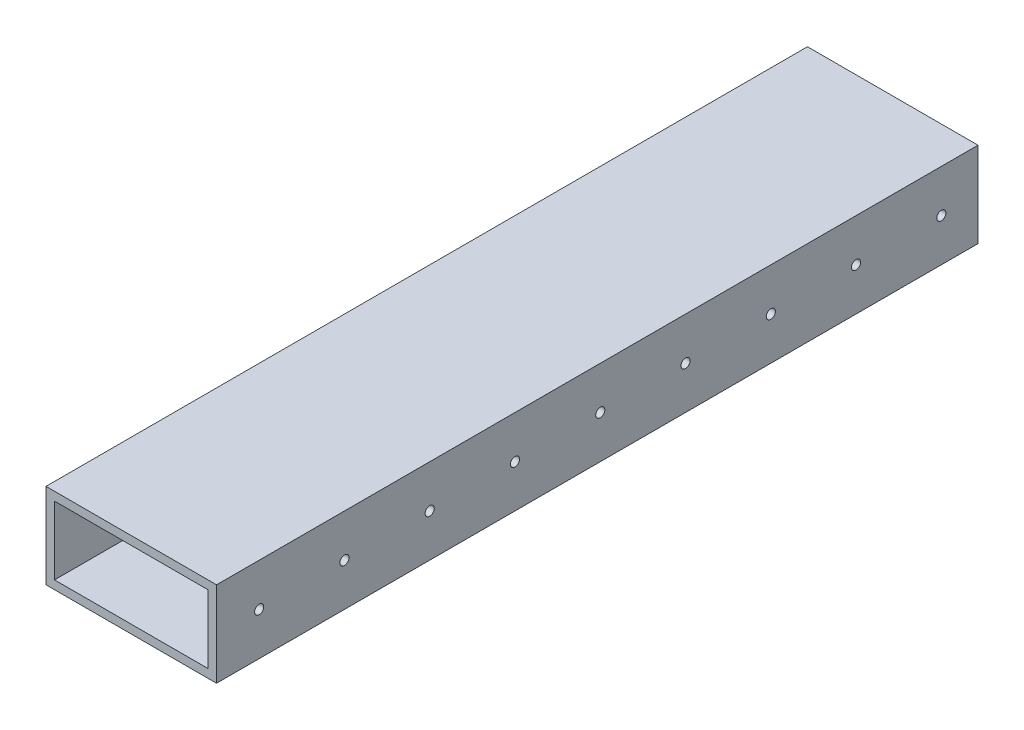
ISO-10303-21;
HEADER;
FILE_DESCRIPTION(('STEP AP214'),'2;1');
FILE_NAME('part.step','',(''),(''),'','','');
FILE_SCHEMA(('AUTOMOTIVE_DESIGN { 1 0 10303 214 1 1 1 1 }'));
ENDSEC;
DATA;
#1=APPLICATION_CONTEXT('core data for automotive mechanical design processes');
#2=APPLICATION_PROTOCOL_DEFINITION('international standard','automotive_design',2000,#1);
#3=PRODUCT_CONTEXT('',#1,'mechanical');
#4=PRODUCT('Part','Part','',(#3));
#5=PRODUCT_RELATED_PRODUCT_CATEGORY('part','',(#4));
#6=PRODUCT_DEFINITION_FORMATION('','',#4);
#7=PRODUCT_DEFINITION_CONTEXT('part definition',#1,'design');
#8=PRODUCT_DEFINITION('design','',#6,#7);
#9=PRODUCT_DEFINITION_SHAPE('','',#8);
#10=(LENGTH_UNIT() NAMED_UNIT(*) SI_UNIT(.MILLI.,.METRE.));
#11=(NAMED_UNIT(*) PLANE_ANGLE_UNIT() SI_UNIT($,.RADIAN.));
#12=(NAMED_UNIT(*) SI_UNIT($,.STERADIAN.) SOLID_ANGLE_UNIT());
#13=UNCERTAINTY_MEASURE_WITH_UNIT(LENGTH_MEASURE(1.E-05),#10,'distance_accuracy_value','');
#14=(GEOMETRIC_REPRESENTATION_CONTEXT(3) GLOBAL_UNCERTAINTY_ASSIGNED_CONTEXT((#13)) GLOBAL_UNIT_ASSIGNED_CONTEXT((#10,
#11,#12)) REPRESENTATION_CONTEXT('',''));
#15=CARTESIAN_POINT('',(0.,0.,0.));
#16=DIRECTION('',(0.,0.,1.));
#17=DIRECTION('',(1.,0.,0.));
#18=AXIS2_PLACEMENT_3D('',#15,#16,#17);
#19=CARTESIAN_POINT('',(-25.4,0.,-102.489));
#20=DIRECTION('',(1.,0.,0.));
#21=DIRECTION('',(0.,0.,-1.));
#22=AXIS2_PLACEMENT_3D('',#19,#20,#21);
#23=CYLINDRICAL_SURFACE('',#22,1.3589);
#24=CARTESIAN_POINT('',(-22.86,0.,-102.489));
#25=DIRECTION('',(1.,0.,0.));
#26=DIRECTION('',(0.,0.,-1.));
#27=AXIS2_PLACEMENT_3D('',#24,#25,#26);
#28=CIRCLE('',#27,1.3589);
#29=CARTESIAN_POINT('',(-22.86,0.,-103.8479));
#30=VERTEX_POINT('',#29);
#31=EDGE_CURVE('E70',#30,#30,#28,.T.);
#32=ORIENTED_EDGE('',*,*,#31,.T.);
#33=EDGE_LOOP('',(#32));
#34=FACE_BOUND('',#33,.T.);
#35=CARTESIAN_POINT('',(-25.4,0.,-102.489));
#36=DIRECTION('',(1.,0.,0.));
#37=DIRECTION('',(0.,0.,-1.));
#38=AXIS2_PLACEMENT_3D('',#35,#36,#37);
#39=CIRCLE('',#38,1.3589);
#40=CARTESIAN_POINT('',(-25.4,0.,-103.8479));
#41=VERTEX_POINT('',#40);
#42=EDGE_CURVE('E12',#41,#41,#39,.T.);
#43=ORIENTED_EDGE('',*,*,#42,.F.);
#44=EDGE_LOOP('',(#43));
#45=FACE_BOUND('',#44,.T.);
#46=ADVANCED_FACE('F63',(#34,#45),#23,.F.);
#47=CARTESIAN_POINT('',(-25.4,0.,-77.089));
#48=DIRECTION('',(1.,0.,0.));
#49=DIRECTION('',(0.,0.,-1.));
#50=AXIS2_PLACEMENT_3D('',#47,#48,#49);
#51=CYLINDRICAL_SURFACE('',#50,1.3589);
#52=CARTESIAN_POINT('',(-22.86,0.,-77.089));
#53=DIRECTION('',(1.,0.,0.));
#54=DIRECTION('',(0.,0.,-1.));
#55=AXIS2_PLACEMENT_3D('',#52,#53,#54);
#56=CIRCLE('',#55,1.3589);
#57=CARTESIAN_POINT('',(-22.86,0.,-78.4479));
#58=VERTEX_POINT('',#57);
#59=EDGE_CURVE('E272',#58,#58,#56,.T.);
#60=ORIENTED_EDGE('',*,*,#59,.T.);
#61=EDGE_LOOP('',(#60));
#62=FACE_BOUND('',#61,.T.);
#63=CARTESIAN_POINT('',(-25.4,0.,-77.089));
#64=DIRECTION('',(1.,0.,0.));
#65=DIRECTION('',(0.,0.,-1.));
#66=AXIS2_PLACEMENT_3D('',#63,#64,#65);
#67=CIRCLE('',#66,1.3589);
#68=CARTESIAN_POINT('',(-25.4,0.,-78.4479));
#69=VERTEX_POINT('',#68);
#70=EDGE_CURVE('E275',#69,#69,#67,.T.);
#71=ORIENTED_EDGE('',*,*,#70,.F.);
#72=EDGE_LOOP('',(#71));
#73=FACE_BOUND('',#72,.T.);
#74=ADVANCED_FACE('F297',(#62,#73),#51,.F.);
#75=CARTESIAN_POINT('',(-25.4,0.,-51.689));
#76=DIRECTION('',(1.,0.,0.));
#77=DIRECTION('',(0.,0.,-1.));
#78=AXIS2_PLACEMENT_3D('',#75,#76,#77);
#79=CYLINDRICAL_SURFACE('',#78,1.3589);
#80=CARTESIAN_POINT('',(-22.86,0.,-51.689));
#81=DIRECTION('',(1.,0.,0.));
#82=DIRECTION('',(0.,0.,-1.));
#83=AXIS2_PLACEMENT_3D('',#80,#81,#82);
#84=CIRCLE('',#83,1.3589);
#85=CARTESIAN_POINT('',(-22.86,0.,-53.0479));
#86=VERTEX_POINT('',#85);
#87=EDGE_CURVE('E266',#86,#86,#84,.T.);
#88=ORIENTED_EDGE('',*,*,#87,.T.);
#89=EDGE_LOOP('',(#88));
#90=FACE_BOUND('',#89,.T.);
#91=CARTESIAN_POINT('',(-25.4,0.,-51.689));
#92=DIRECTION('',(1.,0.,0.));
#93=DIRECTION('',(0.,0.,-1.));
#94=AXIS2_PLACEMENT_3D('',#91,#92,#93);
#95=CIRCLE('',#94,1.3589);
#96=CARTESIAN_POINT('',(-25.4,0.,-53.0479));
#97=VERTEX_POINT('',#96);
#98=EDGE_CURVE('E269',#97,#97,#95,.T.);
#99=ORIENTED_EDGE('',*,*,#98,.F.);
#100=EDGE_LOOP('',(#99));
#101=FACE_BOUND('',#100,.T.);
#102=ADVANCED_FACE('F301',(#90,#101),#79,.F.);
#103=CARTESIAN_POINT('',(-25.4,0.,-26.289));
#104=DIRECTION('',(1.,0.,0.));
#105=DIRECTION('',(0.,0.,-1.));
#106=AXIS2_PLACEMENT_3D('',#103,#104,#105);
#107=CYLINDRICAL_SURFACE('',#106,1.3589);
#108=CARTESIAN_POINT('',(-22.86,0.,-26.289));
#109=DIRECTION('',(1.,0.,0.));
#110=DIRECTION('',(0.,0.,-1.));
#111=AXIS2_PLACEMENT_3D('',#108,#109,#110);
#112=CIRCLE('',#111,1.3589);
#113=CARTESIAN_POINT('',(-22.86,0.,-27.6479));
#114=VERTEX_POINT('',#113);
#115=EDGE_CURVE('E260',#114,#114,#112,.T.);
#116=ORIENTED_EDGE('',*,*,#115,.T.);
#117=EDGE_LOOP('',(#116));
#118=FACE_BOUND('',#117,.T.);
#119=CARTESIAN_POINT('',(-25.4,0.,-26.289));
#120=DIRECTION('',(1.,0.,0.));
#121=DIRECTION('',(0.,0.,-1.));
#122=AXIS2_PLACEMENT_3D('',#119,#120,#121);
#123=CIRCLE('',#122,1.3589);
#124=CARTESIAN_POINT('',(-25.4,0.,-27.6479));
#125=VERTEX_POINT('',#124);
#126=EDGE_CURVE('E263',#125,#125,#123,.T.);
#127=ORIENTED_EDGE('',*,*,#126,.F.);
#128=EDGE_LOOP('',(#127));
#129=FACE_BOUND('',#128,.T.);
#130=ADVANCED_FACE('F306',(#118,#129),#107,.F.);
#131=CARTESIAN_POINT('',(-25.4,0.,-0.889000000000001));
#132=DIRECTION('',(1.,0.,0.));
#133=DIRECTION('',(0.,0.,-1.));
#134=AXIS2_PLACEMENT_3D('',#131,#132,#133);
#135=CYLINDRICAL_SURFACE('',#134,1.3589);
#136=CARTESIAN_POINT('',(-22.86,0.,-0.889000000000001));
#137=DIRECTION('',(1.,0.,0.));
#138=DIRECTION('',(0.,0.,-1.));
#139=AXIS2_PLACEMENT_3D('',#136,#137,#138);
#140=CIRCLE('',#139,1.3589);
#141=CARTESIAN_POINT('',(-22.86,0.,-2.2479));
#142=VERTEX_POINT('',#141);
#143=EDGE_CURVE('E254',#142,#142,#140,.T.);
#144=ORIENTED_EDGE('',*,*,#143,.T.);
#145=EDGE_LOOP('',(#144));
#146=FACE_BOUND('',#145,.T.);
#147=CARTESIAN_POINT('',(-25.4,0.,-0.889000000000001));
#148=DIRECTION('',(1.,0.,0.));
#149=DIRECTION('',(0.,0.,-1.));
#150=AXIS2_PLACEMENT_3D('',#147,#148,#149);
#151=CIRCLE('',#150,1.3589);
#152=CARTESIAN_POINT('',(-25.4,0.,-2.2479));
#153=VERTEX_POINT('',#152);
#154=EDGE_CURVE('E257',#153,#153,#151,.T.);
#155=ORIENTED_EDGE('',*,*,#154,.F.);
#156=EDGE_LOOP('',(#155));
#157=FACE_BOUND('',#156,.T.);
#158=ADVANCED_FACE('F313',(#146,#157),#135,.F.);
#159=CARTESIAN_POINT('',(-25.4,0.,24.511));
#160=DIRECTION('',(1.,0.,0.));
#161=DIRECTION('',(0.,0.,-1.));
#162=AXIS2_PLACEMENT_3D('',#159,#160,#161);
#163=CYLINDRICAL_SURFACE('',#162,1.3589);
#164=CARTESIAN_POINT('',(-22.86,0.,24.511));
#165=DIRECTION('',(1.,0.,0.));
#166=DIRECTION('',(0.,0.,-1.));
#167=AXIS2_PLACEMENT_3D('',#164,#165,#166);
#168=CIRCLE('',#167,1.3589);
#169=CARTESIAN_POINT('',(-22.86,0.,23.1521));
#170=VERTEX_POINT('',#169);
#171=EDGE_CURVE('E248',#170,#170,#168,.T.);
#172=ORIENTED_EDGE('',*,*,#171,.T.);
#173=EDGE_LOOP('',(#172));
#174=FACE_BOUND('',#173,.T.);
#175=CARTESIAN_POINT('',(-25.4,0.,24.511));
#176=DIRECTION('',(1.,0.,0.));
#177=DIRECTION('',(0.,0.,-1.));
#178=AXIS2_PLACEMENT_3D('',#175,#176,#177);
#179=CIRCLE('',#178,1.3589);
#180=CARTESIAN_POINT('',(-25.4,0.,23.1521));
#181=VERTEX_POINT('',#180);
#182=EDGE_CURVE('E251',#181,#181,#179,.T.);
#183=ORIENTED_EDGE('',*,*,#182,.F.);
#184=EDGE_LOOP('',(#183));
#185=FACE_BOUND('',#184,.T.);
#186=ADVANCED_FACE('F317',(#174,#185),#163,.F.);
#187=CARTESIAN_POINT('',(-25.4,0.,49.911));
#188=DIRECTION('',(1.,0.,0.));
#189=DIRECTION('',(0.,0.,-1.));
#190=AXIS2_PLACEMENT_3D('',#187,#188,#189);
#191=CYLINDRICAL_SURFACE('',#190,1.3589);
#192=CARTESIAN_POINT('',(-22.86,0.,49.911));
#193=DIRECTION('',(1.,0.,0.));
#194=DIRECTION('',(0.,0.,-1.));
#195=AXIS2_PLACEMENT_3D('',#192,#193,#194);
#196=CIRCLE('',#195,1.3589);
#197=CARTESIAN_POINT('',(-22.86,0.,48.5521));
#198=VERTEX_POINT('',#197);
#199=EDGE_CURVE('E242',#198,#198,#196,.T.);
#200=ORIENTED_EDGE('',*,*,#199,.T.);
#201=EDGE_LOOP('',(#200));
#202=FACE_BOUND('',#201,.T.);
#203=CARTESIAN_POINT('',(-25.4,0.,49.911));
#204=DIRECTION('',(1.,0.,0.));
#205=DIRECTION('',(0.,0.,-1.));
#206=AXIS2_PLACEMENT_3D('',#203,#204,#205);
#207=CIRCLE('',#206,1.3589);
#208=CARTESIAN_POINT('',(-25.4,0.,48.5521));
#209=VERTEX_POINT('',#208);
#210=EDGE_CURVE('E245',#209,#209,#207,.T.);
#211=ORIENTED_EDGE('',*,*,#210,.F.);
#212=EDGE_LOOP('',(#211));
#213=FACE_BOUND('',#212,.T.);
#214=ADVANCED_FACE('F321',(#202,#213),#191,.F.);
#215=CARTESIAN_POINT('',(-25.4,0.,-102.489));
#216=DIRECTION('',(1.,0.,0.));
#217=DIRECTION('',(0.,0.,-1.));
#218=AXIS2_PLACEMENT_3D('',#215,#216,#217);
#219=CYLINDRICAL_SURFACE('',#218,1.3589);
#220=CARTESIAN_POINT('',(22.86,0.,-102.489));
#221=DIRECTION('',(-1.,0.,0.));
#222=DIRECTION('',(0.,0.,1.));
#223=AXIS2_PLACEMENT_3D('',#220,#221,#222);
#224=CIRCLE('',#223,1.3589);
#225=CARTESIAN_POINT('',(22.86,0.,-101.1301));
#226=VERTEX_POINT('',#225);
#227=EDGE_CURVE('E236',#226,#226,#224,.T.);
#228=ORIENTED_EDGE('',*,*,#227,.T.);
#229=EDGE_LOOP('',(#228));
#230=FACE_BOUND('',#229,.T.);
#231=CARTESIAN_POINT('',(25.4,0.,-102.489));
#232=DIRECTION('',(1.,0.,0.));
#233=DIRECTION('',(0.,0.,-1.));
#234=AXIS2_PLACEMENT_3D('',#231,#232,#233);
#235=CIRCLE('',#234,1.3589);
#236=CARTESIAN_POINT('',(25.4,0.,-103.8479));
#237=VERTEX_POINT('',#236);
#238=EDGE_CURVE('E239',#237,#237,#235,.T.);
#239=ORIENTED_EDGE('',*,*,#238,.T.);
#240=EDGE_LOOP('',(#239));
#241=FACE_BOUND('',#240,.T.);
#242=ADVANCED_FACE('F325',(#230,#241),#219,.F.);
#243=CARTESIAN_POINT('',(-25.4,0.,-77.089));
#244=DIRECTION('',(1.,0.,0.));
#245=DIRECTION('',(0.,0.,-1.));
#246=AXIS2_PLACEMENT_3D('',#243,#244,#245);
#247=CYLINDRICAL_SURFACE('',#246,1.3589);
#248=CARTESIAN_POINT('',(22.86,0.,-77.089));
#249=DIRECTION('',(-1.,0.,0.));
#250=DIRECTION('',(0.,0.,1.));
#251=AXIS2_PLACEMENT_3D('',#248,#249,#250);
#252=CIRCLE('',#251,1.3589);
#253=CARTESIAN_POINT('',(22.86,0.,-75.7301));
#254=VERTEX_POINT('',#253);
#255=EDGE_CURVE('E230',#254,#254,#252,.T.);
#256=ORIENTED_EDGE('',*,*,#255,.T.);
#257=EDGE_LOOP('',(#256));
#258=FACE_BOUND('',#257,.T.);
#259=CARTESIAN_POINT('',(25.4,0.,-77.089));
#260=DIRECTION('',(1.,0.,0.));
#261=DIRECTION('',(0.,0.,-1.));
#262=AXIS2_PLACEMENT_3D('',#259,#260,#261);
#263=CIRCLE('',#262,1.3589);
#264=CARTESIAN_POINT('',(25.4,0.,-78.4479));
#265=VERTEX_POINT('',#264);
#266=EDGE_CURVE('E233',#265,#265,#263,.T.);
#267=ORIENTED_EDGE('',*,*,#266,.T.);
#268=EDGE_LOOP('',(#267));
#269=FACE_BOUND('',#268,.T.);
#270=ADVANCED_FACE('F329',(#258,#269),#247,.F.);
#271=CARTESIAN_POINT('',(-25.4,0.,-51.689));
#272=DIRECTION('',(1.,0.,0.));
#273=DIRECTION('',(0.,0.,-1.));
#274=AXIS2_PLACEMENT_3D('',#271,#272,#273);
#275=CYLINDRICAL_SURFACE('',#274,1.3589);
#276=CARTESIAN_POINT('',(22.86,0.,-51.689));
#277=DIRECTION('',(-1.,0.,0.));
#278=DIRECTION('',(0.,0.,1.));
#279=AXIS2_PLACEMENT_3D('',#276,#277,#278);
#280=CIRCLE('',#279,1.3589);
#281=CARTESIAN_POINT('',(22.86,0.,-50.3301));
#282=VERTEX_POINT('',#281);
#283=EDGE_CURVE('E224',#282,#282,#280,.T.);
#284=ORIENTED_EDGE('',*,*,#283,.T.);
#285=EDGE_LOOP('',(#284));
#286=FACE_BOUND('',#285,.T.);
#287=CARTESIAN_POINT('',(25.4,0.,-51.689));
#288=DIRECTION('',(1.,0.,0.));
#289=DIRECTION('',(0.,0.,-1.));
#290=AXIS2_PLACEMENT_3D('',#287,#288,#289);
#291=CIRCLE('',#290,1.3589);
#292=CARTESIAN_POINT('',(25.4,0.,-53.0479));
#293=VERTEX_POINT('',#292);
#294=EDGE_CURVE('E227',#293,#293,#291,.T.);
#295=ORIENTED_EDGE('',*,*,#294,.T.);
#296=EDGE_LOOP('',(#295));
#297=FACE_BOUND('',#296,.T.);
#298=ADVANCED_FACE('F333',(#286,#297),#275,.F.);
#299=CARTESIAN_POINT('',(-25.4,0.,-26.289));
#300=DIRECTION('',(1.,0.,0.));
#301=DIRECTION('',(0.,0.,-1.));
#302=AXIS2_PLACEMENT_3D('',#299,#300,#301);
#303=CYLINDRICAL_SURFACE('',#302,1.3589);
#304=CARTESIAN_POINT('',(22.86,0.,-26.289));
#305=DIRECTION('',(-1.,0.,0.));
#306=DIRECTION('',(0.,0.,1.));
#307=AXIS2_PLACEMENT_3D('',#304,#305,#306);
#308=CIRCLE('',#307,1.3589);
#309=CARTESIAN_POINT('',(22.86,0.,-24.9301));
#310=VERTEX_POINT('',#309);
#311=EDGE_CURVE('E218',#310,#310,#308,.T.);
#312=ORIENTED_EDGE('',*,*,#311,.T.);
#313=EDGE_LOOP('',(#312));
#314=FACE_BOUND('',#313,.T.);
#315=CARTESIAN_POINT('',(25.4,0.,-26.289));
#316=DIRECTION('',(1.,0.,0.));
#317=DIRECTION('',(0.,0.,-1.));
#318=AXIS2_PLACEMENT_3D('',#315,#316,#317);
#319=CIRCLE('',#318,1.3589);
#320=CARTESIAN_POINT('',(25.4,0.,-27.6479));
#321=VERTEX_POINT('',#320);
#322=EDGE_CURVE('E221',#321,#321,#319,.T.);
#323=ORIENTED_EDGE('',*,*,#322,.T.);
#324=EDGE_LOOP('',(#323));
#325=FACE_BOUND('',#324,.T.);
#326=ADVANCED_FACE('F337',(#314,#325),#303,.F.);
#327=CARTESIAN_POINT('',(-25.4,0.,-0.889000000000001));
#328=DIRECTION('',(1.,0.,0.));
#329=DIRECTION('',(0.,0.,-1.));
#330=AXIS2_PLACEMENT_3D('',#327,#328,#329);
#331=CYLINDRICAL_SURFACE('',#330,1.3589);
#332=CARTESIAN_POINT('',(22.86,0.,-0.889000000000001));
#333=DIRECTION('',(-1.,0.,0.));
#334=DIRECTION('',(0.,0.,1.));
#335=AXIS2_PLACEMENT_3D('',#332,#333,#334);
#336=CIRCLE('',#335,1.3589);
#337=CARTESIAN_POINT('',(22.86,0.,0.4699));
#338=VERTEX_POINT('',#337);
#339=EDGE_CURVE('E212',#338,#338,#336,.T.);
#340=ORIENTED_EDGE('',*,*,#339,.T.);
#341=EDGE_LOOP('',(#340));
#342=FACE_BOUND('',#341,.T.);
#343=CARTESIAN_POINT('',(25.4,0.,-0.889000000000001));
#344=DIRECTION('',(1.,0.,0.));
#345=DIRECTION('',(0.,0.,-1.));
#346=AXIS2_PLACEMENT_3D('',#343,#344,#345);
#347=CIRCLE('',#346,1.3589);
#348=CARTESIAN_POINT('',(25.4,0.,-2.2479));
#349=VERTEX_POINT('',#348);
#350=EDGE_CURVE('E215',#349,#349,#347,.T.);
#351=ORIENTED_EDGE('',*,*,#350,.T.);
#352=EDGE_LOOP('',(#351));
#353=FACE_BOUND('',#352,.T.);
#354=ADVANCED_FACE('F341',(#342,#353),#331,.F.);
#355=CARTESIAN_POINT('',(-25.4,0.,24.511));
#356=DIRECTION('',(1.,0.,0.));
#357=DIRECTION('',(0.,0.,-1.));
#358=AXIS2_PLACEMENT_3D('',#355,#356,#357);
#359=CYLINDRICAL_SURFACE('',#358,1.3589);
#360=CARTESIAN_POINT('',(22.86,0.,24.511));
#361=DIRECTION('',(-1.,0.,0.));
#362=DIRECTION('',(0.,0.,1.));
#363=AXIS2_PLACEMENT_3D('',#360,#361,#362);
#364=CIRCLE('',#363,1.3589);
#365=CARTESIAN_POINT('',(22.86,0.,25.8699));
#366=VERTEX_POINT('',#365);
#367=EDGE_CURVE('E206',#366,#366,#364,.T.);
#368=ORIENTED_EDGE('',*,*,#367,.T.);
#369=EDGE_LOOP('',(#368));
#370=FACE_BOUND('',#369,.T.);
#371=CARTESIAN_POINT('',(25.4,0.,24.511));
#372=DIRECTION('',(1.,0.,0.));
#373=DIRECTION('',(0.,0.,-1.));
#374=AXIS2_PLACEMENT_3D('',#371,#372,#373);
#375=CIRCLE('',#374,1.3589);
#376=CARTESIAN_POINT('',(25.4,0.,23.1521));
#377=VERTEX_POINT('',#376);
#378=EDGE_CURVE('E209',#377,#377,#375,.T.);
#379=ORIENTED_EDGE('',*,*,#378,.T.);
#380=EDGE_LOOP('',(#379));
#381=FACE_BOUND('',#380,.T.);
#382=ADVANCED_FACE('F345',(#370,#381),#359,.F.);
#383=CARTESIAN_POINT('',(-25.4,0.,49.911));
#384=DIRECTION('',(1.,0.,0.));
#385=DIRECTION('',(0.,0.,-1.));
#386=AXIS2_PLACEMENT_3D('',#383,#384,#385);
#387=CYLINDRICAL_SURFACE('',#386,1.3589);
#388=CARTESIAN_POINT('',(22.86,0.,49.911));
#389=DIRECTION('',(-1.,0.,0.));
#390=DIRECTION('',(0.,0.,1.));
#391=AXIS2_PLACEMENT_3D('',#388,#389,#390);
#392=CIRCLE('',#391,1.3589);
#393=CARTESIAN_POINT('',(22.86,0.,51.2699));
#394=VERTEX_POINT('',#393);
#395=EDGE_CURVE('E196',#394,#394,#392,.T.);
#396=ORIENTED_EDGE('',*,*,#395,.T.);
#397=EDGE_LOOP('',(#396));
#398=FACE_BOUND('',#397,.T.);
#399=CARTESIAN_POINT('',(25.4,0.,49.911));
#400=DIRECTION('',(1.,0.,0.));
#401=DIRECTION('',(0.,0.,-1.));
#402=AXIS2_PLACEMENT_3D('',#399,#400,#401);
#403=CIRCLE('',#402,1.3589);
#404=CARTESIAN_POINT('',(25.4,0.,48.5521));
#405=VERTEX_POINT('',#404);
#406=EDGE_CURVE('E203',#405,#405,#403,.T.);
#407=ORIENTED_EDGE('',*,*,#406,.T.);
#408=EDGE_LOOP('',(#407));
#409=FACE_BOUND('',#408,.T.);
#410=ADVANCED_FACE('F349',(#398,#409),#387,.F.);
#411=CARTESIAN_POINT('',(0.,0.,113.411));
#412=DIRECTION('',(0.,0.,1.));
#413=DIRECTION('',(1.,0.,0.));
#414=AXIS2_PLACEMENT_3D('',#411,#412,#413);
#415=PLANE('',#414);
#416=DIRECTION('',(0.,1.,0.));
#417=VECTOR('',#416,1.);
#418=CARTESIAN_POINT('',(25.4,-12.7,113.411));
#419=LINE('',#418,#417);
#420=CARTESIAN_POINT('',(25.4,-12.7,113.411));
#421=VERTEX_POINT('',#420);
#422=CARTESIAN_POINT('',(25.4,12.7,113.411));
#423=VERTEX_POINT('',#422);
#424=EDGE_CURVE('E167',#421,#423,#419,.T.);
#425=ORIENTED_EDGE('',*,*,#424,.T.);
#426=DIRECTION('',(-1.,0.,0.));
#427=VECTOR('',#426,1.);
#428=CARTESIAN_POINT('',(-25.4,12.7,113.411));
#429=LINE('',#428,#427);
#430=CARTESIAN_POINT('',(-25.4,12.7,113.411));
#431=VERTEX_POINT('',#430);
#432=EDGE_CURVE('E170',#423,#431,#429,.T.);
#433=ORIENTED_EDGE('',*,*,#432,.T.);
#434=DIRECTION('',(0.,-1.,0.));
#435=VECTOR('',#434,1.);
#436=CARTESIAN_POINT('',(-25.4,-12.7,113.411));
#437=LINE('',#436,#435);
#438=CARTESIAN_POINT('',(-25.4,-12.7,113.411));
#439=VERTEX_POINT('',#438);
#440=EDGE_CURVE('E173',#431,#439,#437,.T.);
#441=ORIENTED_EDGE('',*,*,#440,.T.);
#442=DIRECTION('',(1.,0.,0.));
#443=VECTOR('',#442,1.);
#444=CARTESIAN_POINT('',(-25.4,-12.7,113.411));
#445=LINE('',#444,#443);
#446=EDGE_CURVE('E175',#439,#421,#445,.T.);
#447=ORIENTED_EDGE('',*,*,#446,.T.);
#448=EDGE_LOOP('',(#425,#433,#441,#447));
#449=FACE_BOUND('',#448,.T.);
#450=DIRECTION('',(-1.,0.,0.));
#451=VECTOR('',#450,1.);
#452=CARTESIAN_POINT('',(0.,10.16,113.411));
#453=LINE('',#452,#451);
#454=CARTESIAN_POINT('',(22.86,10.16,113.411));
#455=VERTEX_POINT('',#454);
#456=CARTESIAN_POINT('',(-22.86,10.16,113.411));
#457=VERTEX_POINT('',#456);
#458=EDGE_CURVE('E136',#455,#457,#453,.T.);
#459=ORIENTED_EDGE('',*,*,#458,.F.);
#460=DIRECTION('',(0.,1.,0.));
#461=VECTOR('',#460,1.);
#462=CARTESIAN_POINT('',(22.86,0.,113.411));
#463=LINE('',#462,#461);
#464=CARTESIAN_POINT('',(22.86,-10.16,113.411));
#465=VERTEX_POINT('',#464);
#466=EDGE_CURVE('E127',#465,#455,#463,.T.);
#467=ORIENTED_EDGE('',*,*,#466,.F.);
#468=DIRECTION('',(1.,0.,0.));
#469=VECTOR('',#468,1.);
#470=CARTESIAN_POINT('',(0.,-10.16,113.411));
#471=LINE('',#470,#469);
#472=CARTESIAN_POINT('',(-22.86,-10.16,113.411));
#473=VERTEX_POINT('',#472);
#474=EDGE_CURVE('E151',#473,#465,#471,.T.);
#475=ORIENTED_EDGE('',*,*,#474,.F.);
#476=DIRECTION('',(0.,-1.,0.));
#477=VECTOR('',#476,1.);
#478=CARTESIAN_POINT('',(-22.86,0.,113.411));
#479=LINE('',#478,#477);
#480=EDGE_CURVE('E149',#457,#473,#479,.T.);
#481=ORIENTED_EDGE('',*,*,#480,.F.);
#482=EDGE_LOOP('',(#459,#467,#475,#481));
#483=FACE_BOUND('',#482,.T.);
#484=ADVANCED_FACE('F148',(#449,#483),#415,.T.);
#485=CARTESIAN_POINT('',(0.,0.,-113.411));
#486=DIRECTION('',(0.,0.,1.));
#487=DIRECTION('',(1.,0.,0.));
#488=AXIS2_PLACEMENT_3D('',#485,#486,#487);
#489=PLANE('',#488);
#490=DIRECTION('',(0.,1.,0.));
#491=VECTOR('',#490,1.);
#492=CARTESIAN_POINT('',(25.4,-12.7,-113.411));
#493=LINE('',#492,#491);
#494=CARTESIAN_POINT('',(25.4,-12.7,-113.411));
#495=VERTEX_POINT('',#494);
#496=CARTESIAN_POINT('',(25.4,12.7,-113.411));
#497=VERTEX_POINT('',#496);
#498=EDGE_CURVE('E144',#495,#497,#493,.T.);
#499=ORIENTED_EDGE('',*,*,#498,.F.);
#500=DIRECTION('',(1.,0.,0.));
#501=VECTOR('',#500,1.);
#502=CARTESIAN_POINT('',(-25.4,-12.7,-113.411));
#503=LINE('',#502,#501);
#504=CARTESIAN_POINT('',(-25.4,-12.7,-113.411));
#505=VERTEX_POINT('',#504);
#506=EDGE_CURVE('E171',#505,#495,#503,.T.);
#507=ORIENTED_EDGE('',*,*,#506,.F.);
#508=DIRECTION('',(0.,-1.,0.));
#509=VECTOR('',#508,1.);
#510=CARTESIAN_POINT('',(-25.4,-12.7,-113.411));
#511=LINE('',#510,#509);
#512=CARTESIAN_POINT('',(-25.4,12.7,-113.411));
#513=VERTEX_POINT('',#512);
#514=EDGE_CURVE('E182',#513,#505,#511,.T.);
#515=ORIENTED_EDGE('',*,*,#514,.F.);
#516=DIRECTION('',(-1.,0.,0.));
#517=VECTOR('',#516,1.);
#518=CARTESIAN_POINT('',(-25.4,12.7,-113.411));
#519=LINE('',#518,#517);
#520=EDGE_CURVE('E180',#497,#513,#519,.T.);
#521=ORIENTED_EDGE('',*,*,#520,.F.);
#522=EDGE_LOOP('',(#499,#507,#515,#521));
#523=FACE_BOUND('',#522,.T.);
#524=DIRECTION('',(0.,1.,0.));
#525=VECTOR('',#524,1.);
#526=CARTESIAN_POINT('',(22.86,0.,-113.411));
#527=LINE('',#526,#525);
#528=CARTESIAN_POINT('',(22.86,-10.16,-113.411));
#529=VERTEX_POINT('',#528);
#530=CARTESIAN_POINT('',(22.86,10.16,-113.411));
#531=VERTEX_POINT('',#530);
#532=EDGE_CURVE('E85',#529,#531,#527,.T.);
#533=ORIENTED_EDGE('',*,*,#532,.T.);
#534=DIRECTION('',(-1.,0.,0.));
#535=VECTOR('',#534,1.);
#536=CARTESIAN_POINT('',(0.,10.16,-113.411));
#537=LINE('',#536,#535);
#538=CARTESIAN_POINT('',(-22.86,10.16,-113.411));
#539=VERTEX_POINT('',#538);
#540=EDGE_CURVE('E143',#531,#539,#537,.T.);
#541=ORIENTED_EDGE('',*,*,#540,.T.);
#542=DIRECTION('',(0.,-1.,0.));
#543=VECTOR('',#542,1.);
#544=CARTESIAN_POINT('',(-22.86,0.,-113.411));
#545=LINE('',#544,#543);
#546=CARTESIAN_POINT('',(-22.86,-10.16,-113.411));
#547=VERTEX_POINT('',#546);
#548=EDGE_CURVE('E159',#539,#547,#545,.T.);
#549=ORIENTED_EDGE('',*,*,#548,.T.);
#550=DIRECTION('',(1.,0.,0.));
#551=VECTOR('',#550,1.);
#552=CARTESIAN_POINT('',(0.,-10.16,-113.411));
#553=LINE('',#552,#551);
#554=EDGE_CURVE('E137',#547,#529,#553,.T.);
#555=ORIENTED_EDGE('',*,*,#554,.T.);
#556=EDGE_LOOP('',(#533,#541,#549,#555));
#557=FACE_BOUND('',#556,.T.);
#558=ADVANCED_FACE('F358',(#523,#557),#489,.F.);
#559=CARTESIAN_POINT('',(25.4,-12.7,113.411));
#560=DIRECTION('',(-1.,0.,0.));
#561=DIRECTION('',(0.,0.,1.));
#562=AXIS2_PLACEMENT_3D('',#559,#560,#561);
#563=PLANE('',#562);
#564=CARTESIAN_POINT('',(25.4,0.,75.311));
#565=DIRECTION('',(1.,0.,0.));
#566=DIRECTION('',(0.,0.,-1.));
#567=AXIS2_PLACEMENT_3D('',#564,#565,#566);
#568=CIRCLE('',#567,1.3589);
#569=CARTESIAN_POINT('',(25.4,0.,73.9521));
#570=VERTEX_POINT('',#569);
#571=EDGE_CURVE('E392',#570,#570,#568,.T.);
#572=ORIENTED_EDGE('',*,*,#571,.F.);
#573=EDGE_LOOP('',(#572));
#574=FACE_BOUND('',#573,.T.);
#575=CARTESIAN_POINT('',(25.4,0.,100.711));
#576=DIRECTION('',(1.,0.,0.));
#577=DIRECTION('',(0.,0.,-1.));
#578=AXIS2_PLACEMENT_3D('',#575,#576,#577);
#579=CIRCLE('',#578,1.3589);
#580=CARTESIAN_POINT('',(25.4,0.,99.3521));
#581=VERTEX_POINT('',#580);
#582=EDGE_CURVE('E389',#581,#581,#579,.T.);
#583=ORIENTED_EDGE('',*,*,#582,.F.);
#584=EDGE_LOOP('',(#583));
#585=FACE_BOUND('',#584,.T.);
#586=ORIENTED_EDGE('',*,*,#498,.T.);
#587=DIRECTION('',(0.,0.,-1.));
#588=VECTOR('',#587,1.);
#589=CARTESIAN_POINT('',(25.4,12.7,113.411));
#590=LINE('',#589,#588);
#591=EDGE_CURVE('E193',#423,#497,#590,.T.);
#592=ORIENTED_EDGE('',*,*,#591,.F.);
#593=ORIENTED_EDGE('',*,*,#424,.F.);
#594=DIRECTION('',(0.,0.,-1.));
#595=VECTOR('',#594,1.);
#596=CARTESIAN_POINT('',(25.4,-12.7,113.411));
#597=LINE('',#596,#595);
#598=EDGE_CURVE('E177',#421,#495,#597,.T.);
#599=ORIENTED_EDGE('',*,*,#598,.T.);
#600=EDGE_LOOP('',(#586,#592,#593,#599));
#601=FACE_BOUND('',#600,.T.);
#602=ORIENTED_EDGE('',*,*,#406,.F.);
#603=EDGE_LOOP('',(#602));
#604=FACE_BOUND('',#603,.T.);
#605=ORIENTED_EDGE('',*,*,#378,.F.);
#606=EDGE_LOOP('',(#605));
#607=FACE_BOUND('',#606,.T.);
#608=ORIENTED_EDGE('',*,*,#350,.F.);
#609=EDGE_LOOP('',(#608));
#610=FACE_BOUND('',#609,.T.);
#611=ORIENTED_EDGE('',*,*,#322,.F.);
#612=EDGE_LOOP('',(#611));
#613=FACE_BOUND('',#612,.T.);
#614=ORIENTED_EDGE('',*,*,#294,.F.);
#615=EDGE_LOOP('',(#614));
#616=FACE_BOUND('',#615,.T.);
#617=ORIENTED_EDGE('',*,*,#266,.F.);
#618=EDGE_LOOP('',(#617));
#619=FACE_BOUND('',#618,.T.);
#620=ORIENTED_EDGE('',*,*,#238,.F.);
#621=EDGE_LOOP('',(#620));
#622=FACE_BOUND('',#621,.T.);
#623=ADVANCED_FACE('F354',(#574,#585,#601,#604,#607,#610,#613,#616,#619,#622),#563,.F.);
#624=CARTESIAN_POINT('',(-25.4,12.7,113.411));
#625=DIRECTION('',(0.,-1.,0.));
#626=DIRECTION('',(0.,0.,-1.));
#627=AXIS2_PLACEMENT_3D('',#624,#625,#626);
#628=PLANE('',#627);
#629=ORIENTED_EDGE('',*,*,#520,.T.);
#630=DIRECTION('',(0.,0.,-1.));
#631=VECTOR('',#630,1.);
#632=CARTESIAN_POINT('',(-25.4,12.7,113.411));
#633=LINE('',#632,#631);
#634=EDGE_CURVE('E190',#431,#513,#633,.T.);
#635=ORIENTED_EDGE('',*,*,#634,.F.);
#636=ORIENTED_EDGE('',*,*,#432,.F.);
#637=ORIENTED_EDGE('',*,*,#591,.T.);
#638=EDGE_LOOP('',(#629,#635,#636,#637));
#639=FACE_BOUND('',#638,.T.);
#640=ADVANCED_FACE('F357',(#639),#628,.F.);
#641=CARTESIAN_POINT('',(-25.4,-12.7,113.411));
#642=DIRECTION('',(1.,0.,0.));
#643=DIRECTION('',(0.,0.,-1.));
#644=AXIS2_PLACEMENT_3D('',#641,#642,#643);
#645=PLANE('',#644);
#646=CARTESIAN_POINT('',(-25.4,0.,75.311));
#647=DIRECTION('',(1.,0.,0.));
#648=DIRECTION('',(0.,0.,-1.));
#649=AXIS2_PLACEMENT_3D('',#646,#647,#648);
#650=CIRCLE('',#649,1.3589);
#651=CARTESIAN_POINT('',(-25.4,0.,73.9521));
#652=VERTEX_POINT('',#651);
#653=EDGE_CURVE('E398',#652,#652,#650,.T.);
#654=ORIENTED_EDGE('',*,*,#653,.T.);
#655=EDGE_LOOP('',(#654));
#656=FACE_BOUND('',#655,.T.);
#657=CARTESIAN_POINT('',(-25.4,0.,100.711));
#658=DIRECTION('',(1.,0.,0.));
#659=DIRECTION('',(0.,0.,-1.));
#660=AXIS2_PLACEMENT_3D('',#657,#658,#659);
#661=CIRCLE('',#660,1.3589);
#662=CARTESIAN_POINT('',(-25.4,0.,99.3521));
#663=VERTEX_POINT('',#662);
#664=EDGE_CURVE('E200',#663,#663,#661,.T.);
#665=ORIENTED_EDGE('',*,*,#664,.T.);
#666=EDGE_LOOP('',(#665));
#667=FACE_BOUND('',#666,.T.);
#668=ORIENTED_EDGE('',*,*,#514,.T.);
#669=DIRECTION('',(0.,0.,-1.));
#670=VECTOR('',#669,1.);
#671=CARTESIAN_POINT('',(-25.4,-12.7,113.411));
#672=LINE('',#671,#670);
#673=EDGE_CURVE('E187',#439,#505,#672,.T.);
#674=ORIENTED_EDGE('',*,*,#673,.F.);
#675=ORIENTED_EDGE('',*,*,#440,.F.);
#676=ORIENTED_EDGE('',*,*,#634,.T.);
#677=EDGE_LOOP('',(#668,#674,#675,#676));
#678=FACE_BOUND('',#677,.T.);
#679=ORIENTED_EDGE('',*,*,#210,.T.);
#680=EDGE_LOOP('',(#679));
#681=FACE_BOUND('',#680,.T.);
#682=ORIENTED_EDGE('',*,*,#182,.T.);
#683=EDGE_LOOP('',(#682));
#684=FACE_BOUND('',#683,.T.);
#685=ORIENTED_EDGE('',*,*,#154,.T.);
#686=EDGE_LOOP('',(#685));
#687=FACE_BOUND('',#686,.T.);
#688=ORIENTED_EDGE('',*,*,#126,.T.);
#689=EDGE_LOOP('',(#688));
#690=FACE_BOUND('',#689,.T.);
#691=ORIENTED_EDGE('',*,*,#98,.T.);
#692=EDGE_LOOP('',(#691));
#693=FACE_BOUND('',#692,.T.);
#694=ORIENTED_EDGE('',*,*,#70,.T.);
#695=EDGE_LOOP('',(#694));
#696=FACE_BOUND('',#695,.T.);
#697=ORIENTED_EDGE('',*,*,#42,.T.);
#698=EDGE_LOOP('',(#697));
#699=FACE_BOUND('',#698,.T.);
#700=ADVANCED_FACE('F362',(#656,#667,#678,#681,#684,#687,#690,#693,#696,#699),#645,.F.);
#701=CARTESIAN_POINT('',(-25.4,-12.7,113.411));
#702=DIRECTION('',(0.,1.,0.));
#703=DIRECTION('',(0.,0.,1.));
#704=AXIS2_PLACEMENT_3D('',#701,#702,#703);
#705=PLANE('',#704);
#706=ORIENTED_EDGE('',*,*,#506,.T.);
#707=ORIENTED_EDGE('',*,*,#598,.F.);
#708=ORIENTED_EDGE('',*,*,#446,.F.);
#709=ORIENTED_EDGE('',*,*,#673,.T.);
#710=EDGE_LOOP('',(#706,#707,#708,#709));
#711=FACE_BOUND('',#710,.T.);
#712=ADVANCED_FACE('F366',(#711),#705,.F.);
#713=CARTESIAN_POINT('',(22.86,0.,113.411));
#714=DIRECTION('',(-1.,0.,0.));
#715=DIRECTION('',(0.,0.,1.));
#716=AXIS2_PLACEMENT_3D('',#713,#714,#715);
#717=PLANE('',#716);
#718=CARTESIAN_POINT('',(22.86,0.,75.311));
#719=DIRECTION('',(-1.,0.,0.));
#720=DIRECTION('',(0.,0.,1.));
#721=AXIS2_PLACEMENT_3D('',#718,#719,#720);
#722=CIRCLE('',#721,1.3589);
#723=CARTESIAN_POINT('',(22.86,0.,76.6699));
#724=VERTEX_POINT('',#723);
#725=EDGE_CURVE('E384',#724,#724,#722,.T.);
#726=ORIENTED_EDGE('',*,*,#725,.F.);
#727=EDGE_LOOP('',(#726));
#728=FACE_BOUND('',#727,.T.);
#729=CARTESIAN_POINT('',(22.86,0.,100.711));
#730=DIRECTION('',(-1.,0.,0.));
#731=DIRECTION('',(0.,0.,1.));
#732=AXIS2_PLACEMENT_3D('',#729,#730,#731);
#733=CIRCLE('',#732,1.3589);
#734=CARTESIAN_POINT('',(22.86,0.,102.0699));
#735=VERTEX_POINT('',#734);
#736=EDGE_CURVE('E157',#735,#735,#733,.T.);
#737=ORIENTED_EDGE('',*,*,#736,.F.);
#738=EDGE_LOOP('',(#737));
#739=FACE_BOUND('',#738,.T.);
#740=ORIENTED_EDGE('',*,*,#532,.F.);
#741=DIRECTION('',(0.,0.,-1.));
#742=VECTOR('',#741,1.);
#743=CARTESIAN_POINT('',(22.86,-10.16,113.411));
#744=LINE('',#743,#742);
#745=EDGE_CURVE('E132',#465,#529,#744,.T.);
#746=ORIENTED_EDGE('',*,*,#745,.F.);
#747=ORIENTED_EDGE('',*,*,#466,.T.);
#748=DIRECTION('',(0.,0.,-1.));
#749=VECTOR('',#748,1.);
#750=CARTESIAN_POINT('',(22.86,10.16,113.411));
#751=LINE('',#750,#749);
#752=EDGE_CURVE('E131',#455,#531,#751,.T.);
#753=ORIENTED_EDGE('',*,*,#752,.T.);
#754=EDGE_LOOP('',(#740,#746,#747,#753));
#755=FACE_BOUND('',#754,.T.);
#756=ORIENTED_EDGE('',*,*,#395,.F.);
#757=EDGE_LOOP('',(#756));
#758=FACE_BOUND('',#757,.T.);
#759=ORIENTED_EDGE('',*,*,#367,.F.);
#760=EDGE_LOOP('',(#759));
#761=FACE_BOUND('',#760,.T.);
#762=ORIENTED_EDGE('',*,*,#339,.F.);
#763=EDGE_LOOP('',(#762));
#764=FACE_BOUND('',#763,.T.);
#765=ORIENTED_EDGE('',*,*,#311,.F.);
#766=EDGE_LOOP('',(#765));
#767=FACE_BOUND('',#766,.T.);
#768=ORIENTED_EDGE('',*,*,#283,.F.);
#769=EDGE_LOOP('',(#768));
#770=FACE_BOUND('',#769,.T.);
#771=ORIENTED_EDGE('',*,*,#255,.F.);
#772=EDGE_LOOP('',(#771));
#773=FACE_BOUND('',#772,.T.);
#774=ORIENTED_EDGE('',*,*,#227,.F.);
#775=EDGE_LOOP('',(#774));
#776=FACE_BOUND('',#775,.T.);
#777=ADVANCED_FACE('F129',(#728,#739,#755,#758,#761,#764,#767,#770,#773,#776),#717,.T.);
#778=CARTESIAN_POINT('',(0.,10.16,113.411));
#779=DIRECTION('',(0.,-1.,0.));
#780=DIRECTION('',(0.,0.,-1.));
#781=AXIS2_PLACEMENT_3D('',#778,#779,#780);
#782=PLANE('',#781);
#783=ORIENTED_EDGE('',*,*,#540,.F.);
#784=ORIENTED_EDGE('',*,*,#752,.F.);
#785=ORIENTED_EDGE('',*,*,#458,.T.);
#786=DIRECTION('',(0.,0.,-1.));
#787=VECTOR('',#786,1.);
#788=CARTESIAN_POINT('',(-22.86,10.16,113.411));
#789=LINE('',#788,#787);
#790=EDGE_CURVE('E145',#457,#539,#789,.T.);
#791=ORIENTED_EDGE('',*,*,#790,.T.);
#792=EDGE_LOOP('',(#783,#784,#785,#791));
#793=FACE_BOUND('',#792,.T.);
#794=ADVANCED_FACE('F140',(#793),#782,.T.);
#795=CARTESIAN_POINT('',(-22.86,0.,113.411));
#796=DIRECTION('',(1.,0.,0.));
#797=DIRECTION('',(0.,0.,-1.));
#798=AXIS2_PLACEMENT_3D('',#795,#796,#797);
#799=PLANE('',#798);
#800=CARTESIAN_POINT('',(-22.86,0.,75.311));
#801=DIRECTION('',(1.,0.,0.));
#802=DIRECTION('',(0.,0.,-1.));
#803=AXIS2_PLACEMENT_3D('',#800,#801,#802);
#804=CIRCLE('',#803,1.3589);
#805=CARTESIAN_POINT('',(-22.86,0.,73.9521));
#806=VERTEX_POINT('',#805);
#807=EDGE_CURVE('E401',#806,#806,#804,.T.);
#808=ORIENTED_EDGE('',*,*,#807,.F.);
#809=EDGE_LOOP('',(#808));
#810=FACE_BOUND('',#809,.T.);
#811=CARTESIAN_POINT('',(-22.86,0.,100.711));
#812=DIRECTION('',(1.,0.,0.));
#813=DIRECTION('',(0.,0.,-1.));
#814=AXIS2_PLACEMENT_3D('',#811,#812,#813);
#815=CIRCLE('',#814,1.3589);
#816=CARTESIAN_POINT('',(-22.86,0.,99.3521));
#817=VERTEX_POINT('',#816);
#818=EDGE_CURVE('E197',#817,#817,#815,.T.);
#819=ORIENTED_EDGE('',*,*,#818,.F.);
#820=EDGE_LOOP('',(#819));
#821=FACE_BOUND('',#820,.T.);
#822=ORIENTED_EDGE('',*,*,#548,.F.);
#823=ORIENTED_EDGE('',*,*,#790,.F.);
#824=ORIENTED_EDGE('',*,*,#480,.T.);
#825=DIRECTION('',(0.,0.,-1.));
#826=VECTOR('',#825,1.);
#827=CARTESIAN_POINT('',(-22.86,-10.16,113.411));
#828=LINE('',#827,#826);
#829=EDGE_CURVE('E77',#473,#547,#828,.T.);
#830=ORIENTED_EDGE('',*,*,#829,.T.);
#831=EDGE_LOOP('',(#822,#823,#824,#830));
#832=FACE_BOUND('',#831,.T.);
#833=ORIENTED_EDGE('',*,*,#199,.F.);
#834=EDGE_LOOP('',(#833));
#835=FACE_BOUND('',#834,.T.);
#836=ORIENTED_EDGE('',*,*,#171,.F.);
#837=EDGE_LOOP('',(#836));
#838=FACE_BOUND('',#837,.T.);
#839=ORIENTED_EDGE('',*,*,#143,.F.);
#840=EDGE_LOOP('',(#839));
#841=FACE_BOUND('',#840,.T.);
#842=ORIENTED_EDGE('',*,*,#115,.F.);
#843=EDGE_LOOP('',(#842));
#844=FACE_BOUND('',#843,.T.);
#845=ORIENTED_EDGE('',*,*,#87,.F.);
#846=EDGE_LOOP('',(#845));
#847=FACE_BOUND('',#846,.T.);
#848=ORIENTED_EDGE('',*,*,#59,.F.);
#849=EDGE_LOOP('',(#848));
#850=FACE_BOUND('',#849,.T.);
#851=ORIENTED_EDGE('',*,*,#31,.F.);
#852=EDGE_LOOP('',(#851));
#853=FACE_BOUND('',#852,.T.);
#854=ADVANCED_FACE('F282',(#810,#821,#832,#835,#838,#841,#844,#847,#850,#853),#799,.T.);
#855=CARTESIAN_POINT('',(0.,-10.16,113.411));
#856=DIRECTION('',(0.,1.,0.));
#857=DIRECTION('',(0.,0.,1.));
#858=AXIS2_PLACEMENT_3D('',#855,#856,#857);
#859=PLANE('',#858);
#860=ORIENTED_EDGE('',*,*,#554,.F.);
#861=ORIENTED_EDGE('',*,*,#829,.F.);
#862=ORIENTED_EDGE('',*,*,#474,.T.);
#863=ORIENTED_EDGE('',*,*,#745,.T.);
#864=EDGE_LOOP('',(#860,#861,#862,#863));
#865=FACE_BOUND('',#864,.T.);
#866=ADVANCED_FACE('F284',(#865),#859,.T.);
#867=CARTESIAN_POINT('',(-25.4,0.,100.711));
#868=DIRECTION('',(1.,0.,0.));
#869=DIRECTION('',(0.,0.,-1.));
#870=AXIS2_PLACEMENT_3D('',#867,#868,#869);
#871=CYLINDRICAL_SURFACE('',#870,1.3589);
#872=ORIENTED_EDGE('',*,*,#818,.T.);
#873=EDGE_LOOP('',(#872));
#874=FACE_BOUND('',#873,.T.);
#875=ORIENTED_EDGE('',*,*,#664,.F.);
#876=EDGE_LOOP('',(#875));
#877=FACE_BOUND('',#876,.T.);
#878=ADVANCED_FACE('F291',(#874,#877),#871,.F.);
#879=ORIENTED_EDGE('',*,*,#736,.T.);
#880=EDGE_LOOP('',(#879));
#881=FACE_BOUND('',#880,.T.);
#882=ORIENTED_EDGE('',*,*,#582,.T.);
#883=EDGE_LOOP('',(#882));
#884=FACE_BOUND('',#883,.T.);
#885=ADVANCED_FACE('F481',(#881,#884),#871,.F.);
#886=CARTESIAN_POINT('',(-25.4,0.,75.311));
#887=DIRECTION('',(1.,0.,0.));
#888=DIRECTION('',(0.,0.,-1.));
#889=AXIS2_PLACEMENT_3D('',#886,#887,#888);
#890=CYLINDRICAL_SURFACE('',#889,1.3589);
#891=ORIENTED_EDGE('',*,*,#725,.T.);
#892=EDGE_LOOP('',(#891));
#893=FACE_BOUND('',#892,.T.);
#894=ORIENTED_EDGE('',*,*,#571,.T.);
#895=EDGE_LOOP('',(#894));
#896=FACE_BOUND('',#895,.T.);
#897=ADVANCED_FACE('F407',(#893,#896),#890,.F.);
#898=CARTESIAN_POINT('',(-25.4,0.,75.311));
#899=DIRECTION('',(1.,0.,0.));
#900=DIRECTION('',(0.,0.,-1.));
#901=AXIS2_PLACEMENT_3D('',#898,#899,#900);
#902=CYLINDRICAL_SURFACE('',#901,1.3589);
#903=ORIENTED_EDGE('',*,*,#807,.T.);
#904=EDGE_LOOP('',(#903));
#905=FACE_BOUND('',#904,.T.);
#906=ORIENTED_EDGE('',*,*,#653,.F.);
#907=EDGE_LOOP('',(#906));
#908=FACE_BOUND('',#907,.T.);
#909=ADVANCED_FACE('F404',(#905,#908),#902,.F.);
#910=CLOSED_SHELL('',(#46,#74,#102,#130,#158,#186,#214,#242,#270,#298,#326,#354,#382,#410,#484,
#558,#623,#640,#700,#712,#777,#794,#854,#866,#878,#885,#897,#909));
#911=MANIFOLD_SOLID_BREP('B2',#910);
#912=ADVANCED_BREP_SHAPE_REPRESENTATION('',(#18,#911),#14);
#913=SHAPE_DEFINITION_REPRESENTATION(#9,#912);
ENDSEC;
END-ISO-10303-21;
